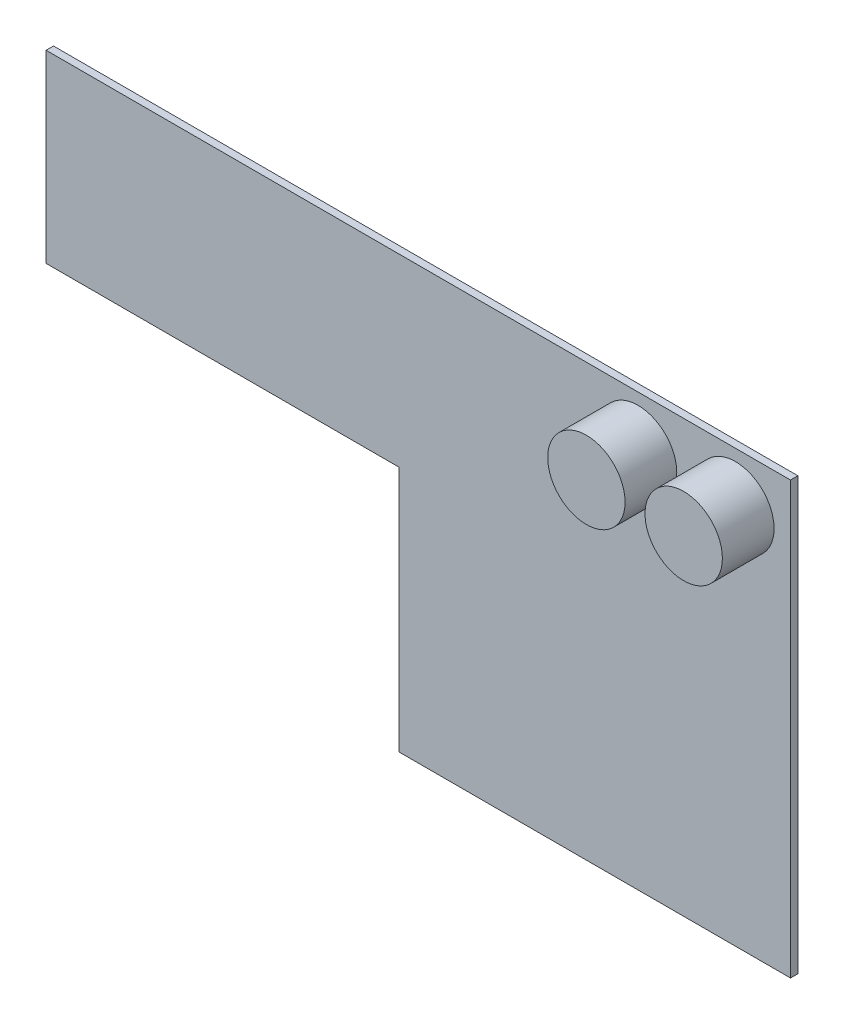
ISO-10303-21;
HEADER;
FILE_DESCRIPTION(('STEP AP214'),'2;1');
FILE_NAME('part.step','',(''),(''),'','','');
FILE_SCHEMA(('AUTOMOTIVE_DESIGN { 1 0 10303 214 1 1 1 1 }'));
ENDSEC;
DATA;
#1=APPLICATION_CONTEXT('core data for automotive mechanical design processes');
#2=APPLICATION_PROTOCOL_DEFINITION('international standard','automotive_design',2000,#1);
#3=PRODUCT_CONTEXT('',#1,'mechanical');
#4=PRODUCT('Part','Part','',(#3));
#5=PRODUCT_RELATED_PRODUCT_CATEGORY('part','',(#4));
#6=PRODUCT_DEFINITION_FORMATION('','',#4);
#7=PRODUCT_DEFINITION_CONTEXT('part definition',#1,'design');
#8=PRODUCT_DEFINITION('design','',#6,#7);
#9=PRODUCT_DEFINITION_SHAPE('','',#8);
#10=(LENGTH_UNIT() NAMED_UNIT(*) SI_UNIT(.MILLI.,.METRE.));
#11=(NAMED_UNIT(*) PLANE_ANGLE_UNIT() SI_UNIT($,.RADIAN.));
#12=(NAMED_UNIT(*) SI_UNIT($,.STERADIAN.) SOLID_ANGLE_UNIT());
#13=UNCERTAINTY_MEASURE_WITH_UNIT(LENGTH_MEASURE(1.E-05),#10,'distance_accuracy_value','');
#14=(GEOMETRIC_REPRESENTATION_CONTEXT(3) GLOBAL_UNCERTAINTY_ASSIGNED_CONTEXT((#13)) GLOBAL_UNIT_ASSIGNED_CONTEXT((#10,
#11,#12)) REPRESENTATION_CONTEXT('',''));
#15=CARTESIAN_POINT('',(0.,0.,0.));
#16=DIRECTION('',(0.,0.,1.));
#17=DIRECTION('',(1.,0.,0.));
#18=AXIS2_PLACEMENT_3D('',#15,#16,#17);
#19=CARTESIAN_POINT('',(0.,0.,5.));
#20=DIRECTION('',(0.,0.,1.));
#21=DIRECTION('',(1.,0.,0.));
#22=AXIS2_PLACEMENT_3D('',#19,#20,#21);
#23=PLANE('',#22);
#24=CARTESIAN_POINT('',(227.68640785312,257.993451028071,5.));
#25=DIRECTION('',(0.,0.,1.));
#26=DIRECTION('',(1.,0.,0.));
#27=AXIS2_PLACEMENT_3D('',#24,#25,#26);
#28=CIRCLE('',#27,26.19375);
#29=CARTESIAN_POINT('',(253.88015785312,257.993451028071,5.));
#30=VERTEX_POINT('',#29);
#31=EDGE_CURVE('E180',#30,#30,#28,.T.);
#32=ORIENTED_EDGE('',*,*,#31,.F.);
#33=EDGE_LOOP('',(#32));
#34=FACE_BOUND('',#33,.T.);
#35=DIRECTION('',(0.,-1.,0.));
#36=VECTOR('',#35,1.);
#37=CARTESIAN_POINT('',(0.,167.,5.));
#38=LINE('',#37,#36);
#39=CARTESIAN_POINT('',(0.,167.,5.));
#40=VERTEX_POINT('',#39);
#41=CARTESIAN_POINT('',(0.,0.,5.));
#42=VERTEX_POINT('',#41);
#43=EDGE_CURVE('E129',#40,#42,#38,.T.);
#44=ORIENTED_EDGE('',*,*,#43,.T.);
#45=DIRECTION('',(1.,0.,0.));
#46=VECTOR('',#45,1.);
#47=CARTESIAN_POINT('',(0.,0.,5.));
#48=LINE('',#47,#46);
#49=CARTESIAN_POINT('',(265.,0.,5.));
#50=VERTEX_POINT('',#49);
#51=EDGE_CURVE('E87',#42,#50,#48,.T.);
#52=ORIENTED_EDGE('',*,*,#51,.T.);
#53=DIRECTION('',(0.,1.,0.));
#54=VECTOR('',#53,1.);
#55=CARTESIAN_POINT('',(265.,0.,5.));
#56=LINE('',#55,#54);
#57=CARTESIAN_POINT('',(265.,292.,5.));
#58=VERTEX_POINT('',#57);
#59=EDGE_CURVE('E100',#50,#58,#56,.T.);
#60=ORIENTED_EDGE('',*,*,#59,.T.);
#61=DIRECTION('',(-1.,0.,0.));
#62=VECTOR('',#61,1.);
#63=CARTESIAN_POINT('',(265.,292.,5.));
#64=LINE('',#63,#62);
#65=CARTESIAN_POINT('',(-239.,292.,5.));
#66=VERTEX_POINT('',#65);
#67=EDGE_CURVE('E94',#58,#66,#64,.T.);
#68=ORIENTED_EDGE('',*,*,#67,.T.);
#69=DIRECTION('',(0.,-1.,0.));
#70=VECTOR('',#69,1.);
#71=CARTESIAN_POINT('',(-239.,292.,5.));
#72=LINE('',#71,#70);
#73=CARTESIAN_POINT('',(-239.,167.,5.));
#74=VERTEX_POINT('',#73);
#75=EDGE_CURVE('E98',#66,#74,#72,.T.);
#76=ORIENTED_EDGE('',*,*,#75,.T.);
#77=DIRECTION('',(1.,0.,0.));
#78=VECTOR('',#77,1.);
#79=CARTESIAN_POINT('',(-239.,167.,5.));
#80=LINE('',#79,#78);
#81=EDGE_CURVE('E50',#74,#40,#80,.T.);
#82=ORIENTED_EDGE('',*,*,#81,.T.);
#83=EDGE_LOOP('',(#44,#52,#60,#68,#76,#82));
#84=FACE_BOUND('',#83,.T.);
#85=CARTESIAN_POINT('',(161.807907248372,257.993451028071,5.));
#86=DIRECTION('',(0.,0.,1.));
#87=DIRECTION('',(1.,0.,0.));
#88=AXIS2_PLACEMENT_3D('',#85,#86,#87);
#89=CIRCLE('',#88,26.19375);
#90=CARTESIAN_POINT('',(188.001657248372,257.993451028071,5.));
#91=VERTEX_POINT('',#90);
#92=EDGE_CURVE('E181',#91,#91,#89,.T.);
#93=ORIENTED_EDGE('',*,*,#92,.F.);
#94=EDGE_LOOP('',(#93));
#95=FACE_BOUND('',#94,.T.);
#96=ADVANCED_FACE('F33',(#34,#84,#95),#23,.T.);
#97=CARTESIAN_POINT('',(0.,167.,5.));
#98=DIRECTION('',(1.,0.,0.));
#99=DIRECTION('',(0.,0.,-1.));
#100=AXIS2_PLACEMENT_3D('',#97,#98,#99);
#101=PLANE('',#100);
#102=DIRECTION('',(0.,-1.,0.));
#103=VECTOR('',#102,1.);
#104=CARTESIAN_POINT('',(0.,167.,0.));
#105=LINE('',#104,#103);
#106=CARTESIAN_POINT('',(0.,167.,0.));
#107=VERTEX_POINT('',#106);
#108=CARTESIAN_POINT('',(0.,0.,0.));
#109=VERTEX_POINT('',#108);
#110=EDGE_CURVE('E118',#107,#109,#105,.T.);
#111=ORIENTED_EDGE('',*,*,#110,.T.);
#112=DIRECTION('',(0.,0.,-1.));
#113=VECTOR('',#112,1.);
#114=CARTESIAN_POINT('',(0.,0.,5.));
#115=LINE('',#114,#113);
#116=EDGE_CURVE('E11',#42,#109,#115,.T.);
#117=ORIENTED_EDGE('',*,*,#116,.F.);
#118=ORIENTED_EDGE('',*,*,#43,.F.);
#119=DIRECTION('',(0.,0.,-1.));
#120=VECTOR('',#119,1.);
#121=CARTESIAN_POINT('',(0.,167.,5.));
#122=LINE('',#121,#120);
#123=EDGE_CURVE('E114',#40,#107,#122,.T.);
#124=ORIENTED_EDGE('',*,*,#123,.T.);
#125=EDGE_LOOP('',(#111,#117,#118,#124));
#126=FACE_BOUND('',#125,.T.);
#127=ADVANCED_FACE('F35',(#126),#101,.F.);
#128=CARTESIAN_POINT('',(0.,0.,5.));
#129=DIRECTION('',(0.,1.,0.));
#130=DIRECTION('',(0.,0.,1.));
#131=AXIS2_PLACEMENT_3D('',#128,#129,#130);
#132=PLANE('',#131);
#133=DIRECTION('',(1.,0.,0.));
#134=VECTOR('',#133,1.);
#135=CARTESIAN_POINT('',(0.,0.,0.));
#136=LINE('',#135,#134);
#137=CARTESIAN_POINT('',(265.,0.,0.));
#138=VERTEX_POINT('',#137);
#139=EDGE_CURVE('E121',#109,#138,#136,.T.);
#140=ORIENTED_EDGE('',*,*,#139,.T.);
#141=DIRECTION('',(0.,0.,-1.));
#142=VECTOR('',#141,1.);
#143=CARTESIAN_POINT('',(265.,0.,5.));
#144=LINE('',#143,#142);
#145=EDGE_CURVE('E42',#50,#138,#144,.T.);
#146=ORIENTED_EDGE('',*,*,#145,.F.);
#147=ORIENTED_EDGE('',*,*,#51,.F.);
#148=ORIENTED_EDGE('',*,*,#116,.T.);
#149=EDGE_LOOP('',(#140,#146,#147,#148));
#150=FACE_BOUND('',#149,.T.);
#151=ADVANCED_FACE('F158',(#150),#132,.F.);
#152=CARTESIAN_POINT('',(265.,0.,5.));
#153=DIRECTION('',(-1.,0.,0.));
#154=DIRECTION('',(0.,0.,1.));
#155=AXIS2_PLACEMENT_3D('',#152,#153,#154);
#156=PLANE('',#155);
#157=DIRECTION('',(0.,1.,0.));
#158=VECTOR('',#157,1.);
#159=CARTESIAN_POINT('',(265.,0.,0.));
#160=LINE('',#159,#158);
#161=CARTESIAN_POINT('',(265.,292.,0.));
#162=VERTEX_POINT('',#161);
#163=EDGE_CURVE('E124',#138,#162,#160,.T.);
#164=ORIENTED_EDGE('',*,*,#163,.T.);
#165=DIRECTION('',(0.,0.,-1.));
#166=VECTOR('',#165,1.);
#167=CARTESIAN_POINT('',(265.,292.,5.));
#168=LINE('',#167,#166);
#169=EDGE_CURVE('E109',#58,#162,#168,.T.);
#170=ORIENTED_EDGE('',*,*,#169,.F.);
#171=ORIENTED_EDGE('',*,*,#59,.F.);
#172=ORIENTED_EDGE('',*,*,#145,.T.);
#173=EDGE_LOOP('',(#164,#170,#171,#172));
#174=FACE_BOUND('',#173,.T.);
#175=ADVANCED_FACE('F135',(#174),#156,.F.);
#176=CARTESIAN_POINT('',(265.,292.,5.));
#177=DIRECTION('',(0.,-1.,0.));
#178=DIRECTION('',(0.,0.,-1.));
#179=AXIS2_PLACEMENT_3D('',#176,#177,#178);
#180=PLANE('',#179);
#181=DIRECTION('',(-1.,0.,0.));
#182=VECTOR('',#181,1.);
#183=CARTESIAN_POINT('',(265.,292.,0.));
#184=LINE('',#183,#182);
#185=CARTESIAN_POINT('',(-239.,292.,0.));
#186=VERTEX_POINT('',#185);
#187=EDGE_CURVE('E108',#162,#186,#184,.T.);
#188=ORIENTED_EDGE('',*,*,#187,.T.);
#189=DIRECTION('',(0.,0.,-1.));
#190=VECTOR('',#189,1.);
#191=CARTESIAN_POINT('',(-239.,292.,5.));
#192=LINE('',#191,#190);
#193=EDGE_CURVE('E105',#66,#186,#192,.T.);
#194=ORIENTED_EDGE('',*,*,#193,.F.);
#195=ORIENTED_EDGE('',*,*,#67,.F.);
#196=ORIENTED_EDGE('',*,*,#169,.T.);
#197=EDGE_LOOP('',(#188,#194,#195,#196));
#198=FACE_BOUND('',#197,.T.);
#199=ADVANCED_FACE('F106',(#198),#180,.F.);
#200=CARTESIAN_POINT('',(-239.,292.,5.));
#201=DIRECTION('',(1.,0.,0.));
#202=DIRECTION('',(0.,1.,0.));
#203=AXIS2_PLACEMENT_3D('',#200,#201,#202);
#204=PLANE('',#203);
#205=DIRECTION('',(0.,-1.,0.));
#206=VECTOR('',#205,1.);
#207=CARTESIAN_POINT('',(-239.,292.,0.));
#208=LINE('',#207,#206);
#209=CARTESIAN_POINT('',(-239.,167.,0.));
#210=VERTEX_POINT('',#209);
#211=EDGE_CURVE('E73',#186,#210,#208,.T.);
#212=ORIENTED_EDGE('',*,*,#211,.T.);
#213=DIRECTION('',(0.,0.,-1.));
#214=VECTOR('',#213,1.);
#215=CARTESIAN_POINT('',(-239.,167.,5.));
#216=LINE('',#215,#214);
#217=EDGE_CURVE('E110',#74,#210,#216,.T.);
#218=ORIENTED_EDGE('',*,*,#217,.F.);
#219=ORIENTED_EDGE('',*,*,#75,.F.);
#220=ORIENTED_EDGE('',*,*,#193,.T.);
#221=EDGE_LOOP('',(#212,#218,#219,#220));
#222=FACE_BOUND('',#221,.T.);
#223=ADVANCED_FACE('F112',(#222),#204,.F.);
#224=CARTESIAN_POINT('',(-239.,167.,5.));
#225=DIRECTION('',(0.,1.,0.));
#226=DIRECTION('',(0.,0.,1.));
#227=AXIS2_PLACEMENT_3D('',#224,#225,#226);
#228=PLANE('',#227);
#229=DIRECTION('',(1.,0.,0.));
#230=VECTOR('',#229,1.);
#231=CARTESIAN_POINT('',(-239.,167.,0.));
#232=LINE('',#231,#230);
#233=EDGE_CURVE('E79',#210,#107,#232,.T.);
#234=ORIENTED_EDGE('',*,*,#233,.T.);
#235=ORIENTED_EDGE('',*,*,#123,.F.);
#236=ORIENTED_EDGE('',*,*,#81,.F.);
#237=ORIENTED_EDGE('',*,*,#217,.T.);
#238=EDGE_LOOP('',(#234,#235,#236,#237));
#239=FACE_BOUND('',#238,.T.);
#240=ADVANCED_FACE('F142',(#239),#228,.F.);
#241=CARTESIAN_POINT('',(0.,0.,0.));
#242=DIRECTION('',(0.,0.,1.));
#243=DIRECTION('',(1.,0.,0.));
#244=AXIS2_PLACEMENT_3D('',#241,#242,#243);
#245=PLANE('',#244);
#246=ORIENTED_EDGE('',*,*,#110,.F.);
#247=ORIENTED_EDGE('',*,*,#233,.F.);
#248=ORIENTED_EDGE('',*,*,#211,.F.);
#249=ORIENTED_EDGE('',*,*,#187,.F.);
#250=ORIENTED_EDGE('',*,*,#163,.F.);
#251=ORIENTED_EDGE('',*,*,#139,.F.);
#252=EDGE_LOOP('',(#246,#247,#248,#249,#250,#251));
#253=FACE_BOUND('',#252,.T.);
#254=ADVANCED_FACE('F138',(#253),#245,.F.);
#255=CARTESIAN_POINT('',(227.68640785312,257.993451028071,40.));
#256=DIRECTION('',(0.,0.,-1.));
#257=DIRECTION('',(-1.,0.,0.));
#258=AXIS2_PLACEMENT_3D('',#255,#256,#257);
#259=CYLINDRICAL_SURFACE('',#258,26.19375);
#260=CARTESIAN_POINT('',(227.68640785312,257.993451028071,40.));
#261=DIRECTION('',(0.,0.,1.));
#262=DIRECTION('',(1.,0.,0.));
#263=AXIS2_PLACEMENT_3D('',#260,#261,#262);
#264=CIRCLE('',#263,26.19375);
#265=CARTESIAN_POINT('',(253.88015785312,257.993451028071,40.));
#266=VERTEX_POINT('',#265);
#267=EDGE_CURVE('E122',#266,#266,#264,.T.);
#268=ORIENTED_EDGE('',*,*,#267,.F.);
#269=EDGE_LOOP('',(#268));
#270=FACE_BOUND('',#269,.T.);
#271=ORIENTED_EDGE('',*,*,#31,.T.);
#272=EDGE_LOOP('',(#271));
#273=FACE_BOUND('',#272,.T.);
#274=ADVANCED_FACE('F149',(#270,#273),#259,.T.);
#275=CARTESIAN_POINT('',(227.68640785312,257.993451028071,40.));
#276=DIRECTION('',(0.,0.,1.));
#277=DIRECTION('',(1.,0.,0.));
#278=AXIS2_PLACEMENT_3D('',#275,#276,#277);
#279=PLANE('',#278);
#280=ORIENTED_EDGE('',*,*,#267,.T.);
#281=EDGE_LOOP('',(#280));
#282=FACE_BOUND('',#281,.T.);
#283=ADVANCED_FACE('F163',(#282),#279,.T.);
#284=CARTESIAN_POINT('',(161.807907248372,257.993451028071,40.));
#285=DIRECTION('',(0.,0.,-1.));
#286=DIRECTION('',(-1.,0.,0.));
#287=AXIS2_PLACEMENT_3D('',#284,#285,#286);
#288=CYLINDRICAL_SURFACE('',#287,26.19375);
#289=CARTESIAN_POINT('',(161.807907248372,257.993451028071,40.));
#290=DIRECTION('',(0.,0.,1.));
#291=DIRECTION('',(1.,0.,0.));
#292=AXIS2_PLACEMENT_3D('',#289,#290,#291);
#293=CIRCLE('',#292,26.19375);
#294=CARTESIAN_POINT('',(188.001657248372,257.993451028071,40.));
#295=VERTEX_POINT('',#294);
#296=EDGE_CURVE('E179',#295,#295,#293,.T.);
#297=ORIENTED_EDGE('',*,*,#296,.F.);
#298=EDGE_LOOP('',(#297));
#299=FACE_BOUND('',#298,.T.);
#300=ORIENTED_EDGE('',*,*,#92,.T.);
#301=EDGE_LOOP('',(#300));
#302=FACE_BOUND('',#301,.T.);
#303=ADVANCED_FACE('F167',(#299,#302),#288,.T.);
#304=CARTESIAN_POINT('',(161.807907248372,257.993451028071,40.));
#305=DIRECTION('',(0.,0.,1.));
#306=DIRECTION('',(1.,0.,0.));
#307=AXIS2_PLACEMENT_3D('',#304,#305,#306);
#308=PLANE('',#307);
#309=ORIENTED_EDGE('',*,*,#296,.T.);
#310=EDGE_LOOP('',(#309));
#311=FACE_BOUND('',#310,.T.);
#312=ADVANCED_FACE('F171',(#311),#308,.T.);
#313=CLOSED_SHELL('',(#96,#127,#151,#175,#199,#223,#240,#254,#274,#283,#303,#312));
#314=MANIFOLD_SOLID_BREP('B2',#313);
#315=ADVANCED_BREP_SHAPE_REPRESENTATION('',(#18,#314),#14);
#316=SHAPE_DEFINITION_REPRESENTATION(#9,#315);
ENDSEC;
END-ISO-10303-21;
